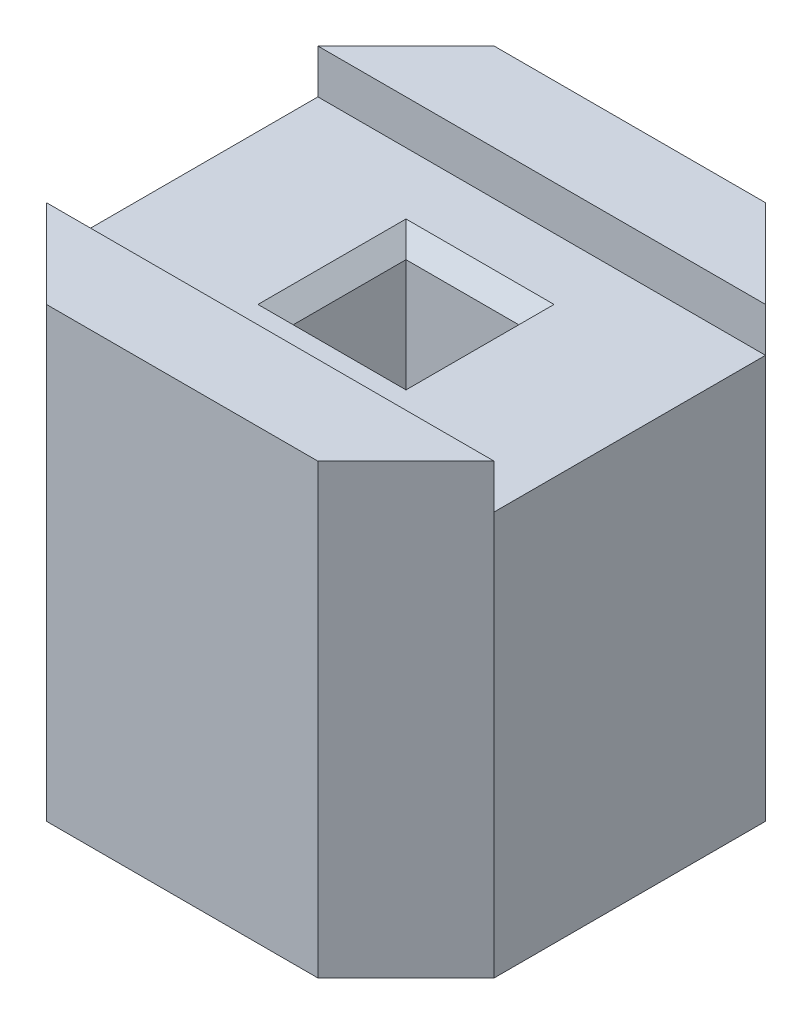
ISO-10303-21;
HEADER;
FILE_DESCRIPTION(('STEP AP214'),'2;1');
FILE_NAME('part.step','',(''),(''),'','','');
FILE_SCHEMA(('AUTOMOTIVE_DESIGN { 1 0 10303 214 1 1 1 1 }'));
ENDSEC;
DATA;
#1=APPLICATION_CONTEXT('core data for automotive mechanical design processes');
#2=APPLICATION_PROTOCOL_DEFINITION('international standard','automotive_design',2000,#1);
#3=PRODUCT_CONTEXT('',#1,'mechanical');
#4=PRODUCT('Part','Part','',(#3));
#5=PRODUCT_RELATED_PRODUCT_CATEGORY('part','',(#4));
#6=PRODUCT_DEFINITION_FORMATION('','',#4);
#7=PRODUCT_DEFINITION_CONTEXT('part definition',#1,'design');
#8=PRODUCT_DEFINITION('design','',#6,#7);
#9=PRODUCT_DEFINITION_SHAPE('','',#8);
#10=(LENGTH_UNIT() NAMED_UNIT(*) SI_UNIT(.MILLI.,.METRE.));
#11=(NAMED_UNIT(*) PLANE_ANGLE_UNIT() SI_UNIT($,.RADIAN.));
#12=(NAMED_UNIT(*) SI_UNIT($,.STERADIAN.) SOLID_ANGLE_UNIT());
#13=UNCERTAINTY_MEASURE_WITH_UNIT(LENGTH_MEASURE(1.E-05),#10,'distance_accuracy_value','');
#14=(GEOMETRIC_REPRESENTATION_CONTEXT(3) GLOBAL_UNCERTAINTY_ASSIGNED_CONTEXT((#13)) GLOBAL_UNIT_ASSIGNED_CONTEXT((#10,
#11,#12)) REPRESENTATION_CONTEXT('',''));
#15=CARTESIAN_POINT('',(0.,0.,0.));
#16=DIRECTION('',(0.,0.,1.));
#17=DIRECTION('',(1.,0.,0.));
#18=AXIS2_PLACEMENT_3D('',#15,#16,#17);
#19=CARTESIAN_POINT('',(0.,0.,2.54));
#20=DIRECTION('',(1.,0.,0.));
#21=DIRECTION('',(0.,0.,-1.));
#22=AXIS2_PLACEMENT_3D('',#19,#20,#21);
#23=PLANE('',#22);
#24=DIRECTION('',(0.,0.,1.));
#25=VECTOR('',#24,1.);
#26=CARTESIAN_POINT('',(0.,-0.25,0.5));
#27=LINE('',#26,#25);
#28=CARTESIAN_POINT('',(0.,-0.25,0.5));
#29=VERTEX_POINT('',#28);
#30=CARTESIAN_POINT('',(0.,-0.25,2.04));
#31=VERTEX_POINT('',#30);
#32=EDGE_CURVE('E171',#29,#31,#27,.T.);
#33=ORIENTED_EDGE('',*,*,#32,.F.);
#34=DIRECTION('',(0.,-1.,0.));
#35=VECTOR('',#34,1.);
#36=CARTESIAN_POINT('',(0.,0.,0.5));
#37=LINE('',#36,#35);
#38=CARTESIAN_POINT('',(0.,-2.54,0.500000000000001));
#39=VERTEX_POINT('',#38);
#40=EDGE_CURVE('E220',#29,#39,#37,.T.);
#41=ORIENTED_EDGE('',*,*,#40,.T.);
#42=DIRECTION('',(0.,0.,-1.));
#43=VECTOR('',#42,1.);
#44=CARTESIAN_POINT('',(0.,-2.54,2.54));
#45=LINE('',#44,#43);
#46=CARTESIAN_POINT('',(0.,-2.54,2.04));
#47=VERTEX_POINT('',#46);
#48=EDGE_CURVE('E203',#47,#39,#45,.T.);
#49=ORIENTED_EDGE('',*,*,#48,.F.);
#50=DIRECTION('',(0.,1.,0.));
#51=VECTOR('',#50,1.);
#52=CARTESIAN_POINT('',(0.,0.,2.04));
#53=LINE('',#52,#51);
#54=EDGE_CURVE('E223',#47,#31,#53,.T.);
#55=ORIENTED_EDGE('',*,*,#54,.T.);
#56=EDGE_LOOP('',(#33,#41,#49,#55));
#57=FACE_BOUND('',#56,.T.);
#58=ADVANCED_FACE('F32',(#57),#23,.F.);
#59=CARTESIAN_POINT('',(2.54,0.,2.54));
#60=DIRECTION('',(-1.,0.,0.));
#61=DIRECTION('',(0.,-1.,0.));
#62=AXIS2_PLACEMENT_3D('',#59,#60,#61);
#63=PLANE('',#62);
#64=DIRECTION('',(0.,0.,1.));
#65=VECTOR('',#64,1.);
#66=CARTESIAN_POINT('',(2.54,-0.25,0.5));
#67=LINE('',#66,#65);
#68=CARTESIAN_POINT('',(2.54,-0.25,0.5));
#69=VERTEX_POINT('',#68);
#70=CARTESIAN_POINT('',(2.54,-0.25,2.04));
#71=VERTEX_POINT('',#70);
#72=EDGE_CURVE('E177',#69,#71,#67,.T.);
#73=ORIENTED_EDGE('',*,*,#72,.T.);
#74=DIRECTION('',(0.,-1.,0.));
#75=VECTOR('',#74,1.);
#76=CARTESIAN_POINT('',(2.54,-2.54,2.04));
#77=LINE('',#76,#75);
#78=CARTESIAN_POINT('',(2.54,-2.54,2.04));
#79=VERTEX_POINT('',#78);
#80=EDGE_CURVE('E240',#71,#79,#77,.T.);
#81=ORIENTED_EDGE('',*,*,#80,.T.);
#82=DIRECTION('',(0.,0.,-1.));
#83=VECTOR('',#82,1.);
#84=CARTESIAN_POINT('',(2.54,-2.54,2.54));
#85=LINE('',#84,#83);
#86=CARTESIAN_POINT('',(2.54,-2.54,0.5));
#87=VERTEX_POINT('',#86);
#88=EDGE_CURVE('E196',#79,#87,#85,.T.);
#89=ORIENTED_EDGE('',*,*,#88,.T.);
#90=DIRECTION('',(0.,1.,0.));
#91=VECTOR('',#90,1.);
#92=CARTESIAN_POINT('',(2.54,0.,0.5));
#93=LINE('',#92,#91);
#94=EDGE_CURVE('E243',#87,#69,#93,.T.);
#95=ORIENTED_EDGE('',*,*,#94,.T.);
#96=EDGE_LOOP('',(#73,#81,#89,#95));
#97=FACE_BOUND('',#96,.T.);
#98=ADVANCED_FACE('F305',(#97),#63,.F.);
#99=CARTESIAN_POINT('',(0.,0.,2.54));
#100=DIRECTION('',(0.,-1.,0.));
#101=DIRECTION('',(0.,0.,-1.));
#102=AXIS2_PLACEMENT_3D('',#99,#100,#101);
#103=PLANE('',#102);
#104=DIRECTION('',(1.,0.,0.));
#105=VECTOR('',#104,1.);
#106=CARTESIAN_POINT('',(0.,0.,0.5));
#107=LINE('',#106,#105);
#108=CARTESIAN_POINT('',(0.,0.,0.5));
#109=VERTEX_POINT('',#108);
#110=CARTESIAN_POINT('',(2.54,0.,0.5));
#111=VERTEX_POINT('',#110);
#112=EDGE_CURVE('E166',#109,#111,#107,.T.);
#113=ORIENTED_EDGE('',*,*,#112,.T.);
#114=DIRECTION('',(0.707106781186548,0.,0.707106781186547));
#115=VECTOR('',#114,1.);
#116=CARTESIAN_POINT('',(2.54,0.,0.5));
#117=LINE('',#116,#115);
#118=CARTESIAN_POINT('',(2.04,0.,0.));
#119=VERTEX_POINT('',#118);
#120=EDGE_CURVE('E229',#111,#119,#117,.F.);
#121=ORIENTED_EDGE('',*,*,#120,.T.);
#122=DIRECTION('',(-1.,0.,0.));
#123=VECTOR('',#122,1.);
#124=CARTESIAN_POINT('',(0.,0.,0.));
#125=LINE('',#124,#123);
#126=CARTESIAN_POINT('',(0.500000000000001,0.,0.));
#127=VERTEX_POINT('',#126);
#128=EDGE_CURVE('E193',#119,#127,#125,.T.);
#129=ORIENTED_EDGE('',*,*,#128,.T.);
#130=DIRECTION('',(0.707106781186548,0.,-0.707106781186547));
#131=VECTOR('',#130,1.);
#132=CARTESIAN_POINT('',(0.,0.,0.5));
#133=LINE('',#132,#131);
#134=EDGE_CURVE('E231',#127,#109,#133,.F.);
#135=ORIENTED_EDGE('',*,*,#134,.T.);
#136=EDGE_LOOP('',(#113,#121,#129,#135));
#137=FACE_BOUND('',#136,.T.);
#138=ADVANCED_FACE('F311',(#137),#103,.F.);
#139=CARTESIAN_POINT('',(0.,-2.54,2.54));
#140=DIRECTION('',(0.,1.,0.));
#141=DIRECTION('',(0.,0.,1.));
#142=AXIS2_PLACEMENT_3D('',#139,#140,#141);
#143=PLANE('',#142);
#144=DIRECTION('',(1.,0.,0.));
#145=VECTOR('',#144,1.);
#146=CARTESIAN_POINT('',(0.,-2.54,1.59));
#147=LINE('',#146,#145);
#148=CARTESIAN_POINT('',(0.95,-2.54,1.59));
#149=VERTEX_POINT('',#148);
#150=CARTESIAN_POINT('',(1.59,-2.54,1.59));
#151=VERTEX_POINT('',#150);
#152=EDGE_CURVE('E163',#149,#151,#147,.T.);
#153=ORIENTED_EDGE('',*,*,#152,.T.);
#154=DIRECTION('',(0.,0.,-1.));
#155=VECTOR('',#154,1.);
#156=CARTESIAN_POINT('',(1.59,-2.54,2.54));
#157=LINE('',#156,#155);
#158=CARTESIAN_POINT('',(1.59,-2.54,0.95));
#159=VERTEX_POINT('',#158);
#160=EDGE_CURVE('E157',#151,#159,#157,.T.);
#161=ORIENTED_EDGE('',*,*,#160,.T.);
#162=DIRECTION('',(-1.,0.,0.));
#163=VECTOR('',#162,1.);
#164=CARTESIAN_POINT('',(0.,-2.54,0.95));
#165=LINE('',#164,#163);
#166=CARTESIAN_POINT('',(0.95,-2.54,0.95));
#167=VERTEX_POINT('',#166);
#168=EDGE_CURVE('E145',#159,#167,#165,.T.);
#169=ORIENTED_EDGE('',*,*,#168,.T.);
#170=DIRECTION('',(0.,0.,1.));
#171=VECTOR('',#170,1.);
#172=CARTESIAN_POINT('',(0.95,-2.54,2.54));
#173=LINE('',#172,#171);
#174=EDGE_CURVE('E153',#167,#149,#173,.T.);
#175=ORIENTED_EDGE('',*,*,#174,.T.);
#176=EDGE_LOOP('',(#153,#161,#169,#175));
#177=FACE_BOUND('',#176,.T.);
#178=DIRECTION('',(1.,0.,0.));
#179=VECTOR('',#178,1.);
#180=CARTESIAN_POINT('',(0.,-2.54,2.54));
#181=LINE('',#180,#179);
#182=CARTESIAN_POINT('',(0.5,-2.54,2.54));
#183=VERTEX_POINT('',#182);
#184=CARTESIAN_POINT('',(2.04,-2.54,2.54));
#185=VERTEX_POINT('',#184);
#186=EDGE_CURVE('E189',#183,#185,#181,.T.);
#187=ORIENTED_EDGE('',*,*,#186,.F.);
#188=DIRECTION('',(-0.707106781186547,0.,-0.707106781186548));
#189=VECTOR('',#188,1.);
#190=CARTESIAN_POINT('',(0.5,-2.54,2.54));
#191=LINE('',#190,#189);
#192=EDGE_CURVE('E218',#183,#47,#191,.T.);
#193=ORIENTED_EDGE('',*,*,#192,.T.);
#194=ORIENTED_EDGE('',*,*,#48,.T.);
#195=DIRECTION('',(-0.707106781186548,0.,0.707106781186547));
#196=VECTOR('',#195,1.);
#197=CARTESIAN_POINT('',(0.,-2.54,0.5));
#198=LINE('',#197,#196);
#199=CARTESIAN_POINT('',(0.500000000000001,-2.54,0.));
#200=VERTEX_POINT('',#199);
#201=EDGE_CURVE('E216',#39,#200,#198,.F.);
#202=ORIENTED_EDGE('',*,*,#201,.T.);
#203=DIRECTION('',(1.,0.,0.));
#204=VECTOR('',#203,1.);
#205=CARTESIAN_POINT('',(0.,-2.54,0.));
#206=LINE('',#205,#204);
#207=CARTESIAN_POINT('',(2.04,-2.54,0.));
#208=VERTEX_POINT('',#207);
#209=EDGE_CURVE('E187',#200,#208,#206,.T.);
#210=ORIENTED_EDGE('',*,*,#209,.T.);
#211=DIRECTION('',(-0.707106781186548,0.,-0.707106781186547));
#212=VECTOR('',#211,1.);
#213=CARTESIAN_POINT('',(2.54,-2.54,0.5));
#214=LINE('',#213,#212);
#215=EDGE_CURVE('E214',#208,#87,#214,.F.);
#216=ORIENTED_EDGE('',*,*,#215,.T.);
#217=ORIENTED_EDGE('',*,*,#88,.F.);
#218=DIRECTION('',(-0.707106781186546,0.,0.707106781186549));
#219=VECTOR('',#218,1.);
#220=CARTESIAN_POINT('',(2.04,-2.54,2.54));
#221=LINE('',#220,#219);
#222=EDGE_CURVE('E212',#79,#185,#221,.T.);
#223=ORIENTED_EDGE('',*,*,#222,.T.);
#224=EDGE_LOOP('',(#187,#193,#194,#202,#210,#216,#217,#223));
#225=FACE_BOUND('',#224,.T.);
#226=ADVANCED_FACE('F161',(#177,#225),#143,.F.);
#227=DIRECTION('',(0.707106781186546,0.,-0.707106781186549));
#228=VECTOR('',#227,1.);
#229=CARTESIAN_POINT('',(2.04,0.,2.54));
#230=LINE('',#229,#228);
#231=CARTESIAN_POINT('',(2.04,0.,2.54));
#232=VERTEX_POINT('',#231);
#233=CARTESIAN_POINT('',(2.54,0.,2.04));
#234=VERTEX_POINT('',#233);
#235=EDGE_CURVE('E226',#232,#234,#230,.T.);
#236=ORIENTED_EDGE('',*,*,#235,.T.);
#237=DIRECTION('',(1.,0.,0.));
#238=VECTOR('',#237,1.);
#239=CARTESIAN_POINT('',(0.,0.,2.04));
#240=LINE('',#239,#238);
#241=CARTESIAN_POINT('',(0.,0.,2.04));
#242=VERTEX_POINT('',#241);
#243=EDGE_CURVE('E164',#242,#234,#240,.T.);
#244=ORIENTED_EDGE('',*,*,#243,.F.);
#245=DIRECTION('',(0.707106781186547,0.,0.707106781186548));
#246=VECTOR('',#245,1.);
#247=CARTESIAN_POINT('',(0.5,0.,2.54));
#248=LINE('',#247,#246);
#249=CARTESIAN_POINT('',(0.5,0.,2.54));
#250=VERTEX_POINT('',#249);
#251=EDGE_CURVE('E234',#242,#250,#248,.T.);
#252=ORIENTED_EDGE('',*,*,#251,.T.);
#253=DIRECTION('',(-1.,0.,0.));
#254=VECTOR('',#253,1.);
#255=CARTESIAN_POINT('',(0.,0.,2.54));
#256=LINE('',#255,#254);
#257=EDGE_CURVE('E192',#232,#250,#256,.T.);
#258=ORIENTED_EDGE('',*,*,#257,.F.);
#259=EDGE_LOOP('',(#236,#244,#252,#258));
#260=FACE_BOUND('',#259,.T.);
#261=ADVANCED_FACE('F386',(#260),#103,.F.);
#262=CARTESIAN_POINT('',(0.,0.,2.54));
#263=DIRECTION('',(0.,0.,1.));
#264=DIRECTION('',(1.,0.,0.));
#265=AXIS2_PLACEMENT_3D('',#262,#263,#264);
#266=PLANE('',#265);
#267=ORIENTED_EDGE('',*,*,#257,.T.);
#268=DIRECTION('',(0.,-1.,0.));
#269=VECTOR('',#268,1.);
#270=CARTESIAN_POINT('',(0.5,-2.54,2.54));
#271=LINE('',#270,#269);
#272=EDGE_CURVE('E209',#250,#183,#271,.T.);
#273=ORIENTED_EDGE('',*,*,#272,.T.);
#274=ORIENTED_EDGE('',*,*,#186,.T.);
#275=DIRECTION('',(0.,1.,0.));
#276=VECTOR('',#275,1.);
#277=CARTESIAN_POINT('',(2.04,0.,2.54));
#278=LINE('',#277,#276);
#279=EDGE_CURVE('E206',#185,#232,#278,.T.);
#280=ORIENTED_EDGE('',*,*,#279,.T.);
#281=EDGE_LOOP('',(#267,#273,#274,#280));
#282=FACE_BOUND('',#281,.T.);
#283=ADVANCED_FACE('F439',(#282),#266,.T.);
#284=CARTESIAN_POINT('',(0.,0.,0.));
#285=DIRECTION('',(0.,0.,1.));
#286=DIRECTION('',(1.,0.,0.));
#287=AXIS2_PLACEMENT_3D('',#284,#285,#286);
#288=PLANE('',#287);
#289=ORIENTED_EDGE('',*,*,#209,.F.);
#290=DIRECTION('',(0.,1.,0.));
#291=VECTOR('',#290,1.);
#292=CARTESIAN_POINT('',(0.500000000000001,0.,0.));
#293=LINE('',#292,#291);
#294=EDGE_CURVE('E238',#200,#127,#293,.T.);
#295=ORIENTED_EDGE('',*,*,#294,.T.);
#296=ORIENTED_EDGE('',*,*,#128,.F.);
#297=DIRECTION('',(0.,-1.,0.));
#298=VECTOR('',#297,1.);
#299=CARTESIAN_POINT('',(2.04,0.,0.));
#300=LINE('',#299,#298);
#301=EDGE_CURVE('E236',#119,#208,#300,.T.);
#302=ORIENTED_EDGE('',*,*,#301,.T.);
#303=EDGE_LOOP('',(#289,#295,#296,#302));
#304=FACE_BOUND('',#303,.T.);
#305=ADVANCED_FACE('F321',(#304),#288,.F.);
#306=CARTESIAN_POINT('',(0.5,0.,2.54));
#307=DIRECTION('',(-0.707106781186548,0.,0.707106781186547));
#308=DIRECTION('',(0.,1.,0.));
#309=AXIS2_PLACEMENT_3D('',#306,#307,#308);
#310=PLANE('',#309);
#311=ORIENTED_EDGE('',*,*,#251,.F.);
#312=DIRECTION('',(0.,1.,0.));
#313=VECTOR('',#312,1.);
#314=CARTESIAN_POINT('',(0.,-0.25,2.04));
#315=LINE('',#314,#313);
#316=EDGE_CURVE('E181',#31,#242,#315,.T.);
#317=ORIENTED_EDGE('',*,*,#316,.F.);
#318=ORIENTED_EDGE('',*,*,#54,.F.);
#319=ORIENTED_EDGE('',*,*,#192,.F.);
#320=ORIENTED_EDGE('',*,*,#272,.F.);
#321=EDGE_LOOP('',(#311,#317,#318,#319,#320));
#322=FACE_BOUND('',#321,.T.);
#323=ADVANCED_FACE('F317',(#322),#310,.T.);
#324=CARTESIAN_POINT('',(0.,0.,0.5));
#325=DIRECTION('',(0.707106781186547,0.,0.707106781186548));
#326=DIRECTION('',(0.,-1.,0.));
#327=AXIS2_PLACEMENT_3D('',#324,#325,#326);
#328=PLANE('',#327);
#329=ORIENTED_EDGE('',*,*,#134,.F.);
#330=ORIENTED_EDGE('',*,*,#294,.F.);
#331=ORIENTED_EDGE('',*,*,#201,.F.);
#332=ORIENTED_EDGE('',*,*,#40,.F.);
#333=EDGE_CURVE('E221',#109,#29,#37,.T.);
#334=ORIENTED_EDGE('',*,*,#333,.F.);
#335=EDGE_LOOP('',(#329,#330,#331,#332,#334));
#336=FACE_BOUND('',#335,.T.);
#337=ADVANCED_FACE('F320',(#336),#328,.F.);
#338=CARTESIAN_POINT('',(2.54,0.,0.5));
#339=DIRECTION('',(-0.707106781186547,0.,0.707106781186548));
#340=DIRECTION('',(0.,1.,0.));
#341=AXIS2_PLACEMENT_3D('',#338,#339,#340);
#342=PLANE('',#341);
#343=ORIENTED_EDGE('',*,*,#215,.F.);
#344=ORIENTED_EDGE('',*,*,#301,.F.);
#345=ORIENTED_EDGE('',*,*,#120,.F.);
#346=DIRECTION('',(0.,1.,0.));
#347=VECTOR('',#346,1.);
#348=CARTESIAN_POINT('',(2.54,-0.25,0.5));
#349=LINE('',#348,#347);
#350=EDGE_CURVE('E185',#69,#111,#349,.T.);
#351=ORIENTED_EDGE('',*,*,#350,.F.);
#352=ORIENTED_EDGE('',*,*,#94,.F.);
#353=EDGE_LOOP('',(#343,#344,#345,#351,#352));
#354=FACE_BOUND('',#353,.T.);
#355=ADVANCED_FACE('F325',(#354),#342,.F.);
#356=CARTESIAN_POINT('',(2.04,0.,2.54));
#357=DIRECTION('',(0.707106781186549,0.,0.707106781186546));
#358=DIRECTION('',(0.,-1.,0.));
#359=AXIS2_PLACEMENT_3D('',#356,#357,#358);
#360=PLANE('',#359);
#361=ORIENTED_EDGE('',*,*,#222,.F.);
#362=ORIENTED_EDGE('',*,*,#80,.F.);
#363=EDGE_CURVE('E241',#234,#71,#77,.T.);
#364=ORIENTED_EDGE('',*,*,#363,.F.);
#365=ORIENTED_EDGE('',*,*,#235,.F.);
#366=ORIENTED_EDGE('',*,*,#279,.F.);
#367=EDGE_LOOP('',(#361,#362,#364,#365,#366));
#368=FACE_BOUND('',#367,.T.);
#369=ADVANCED_FACE('F329',(#368),#360,.T.);
#370=CARTESIAN_POINT('',(0.,-0.25,0.5));
#371=DIRECTION('',(0.,0.,1.));
#372=DIRECTION('',(1.,0.,0.));
#373=AXIS2_PLACEMENT_3D('',#370,#371,#372);
#374=PLANE('',#373);
#375=ORIENTED_EDGE('',*,*,#112,.F.);
#376=ORIENTED_EDGE('',*,*,#333,.T.);
#377=DIRECTION('',(1.,0.,0.));
#378=VECTOR('',#377,1.);
#379=CARTESIAN_POINT('',(0.,-0.25,0.5));
#380=LINE('',#379,#378);
#381=EDGE_CURVE('E180',#29,#69,#380,.T.);
#382=ORIENTED_EDGE('',*,*,#381,.T.);
#383=ORIENTED_EDGE('',*,*,#350,.T.);
#384=EDGE_LOOP('',(#375,#376,#382,#383));
#385=FACE_BOUND('',#384,.T.);
#386=ADVANCED_FACE('F333',(#385),#374,.T.);
#387=CARTESIAN_POINT('',(0.,-0.25,2.04));
#388=DIRECTION('',(0.,0.,1.));
#389=DIRECTION('',(1.,0.,0.));
#390=AXIS2_PLACEMENT_3D('',#387,#388,#389);
#391=PLANE('',#390);
#392=ORIENTED_EDGE('',*,*,#243,.T.);
#393=ORIENTED_EDGE('',*,*,#363,.T.);
#394=DIRECTION('',(1.,0.,0.));
#395=VECTOR('',#394,1.);
#396=CARTESIAN_POINT('',(0.,-0.25,2.04));
#397=LINE('',#396,#395);
#398=EDGE_CURVE('E174',#31,#71,#397,.T.);
#399=ORIENTED_EDGE('',*,*,#398,.F.);
#400=ORIENTED_EDGE('',*,*,#316,.T.);
#401=EDGE_LOOP('',(#392,#393,#399,#400));
#402=FACE_BOUND('',#401,.T.);
#403=ADVANCED_FACE('F375',(#402),#391,.F.);
#404=CARTESIAN_POINT('',(0.,-0.25,0.));
#405=DIRECTION('',(0.,1.,0.));
#406=DIRECTION('',(0.,0.,1.));
#407=AXIS2_PLACEMENT_3D('',#404,#405,#406);
#408=PLANE('',#407);
#409=DIRECTION('',(0.,0.,1.));
#410=VECTOR('',#409,1.);
#411=CARTESIAN_POINT('',(1.69,-0.25,1.59));
#412=LINE('',#411,#410);
#413=CARTESIAN_POINT('',(1.69,-0.25,0.849999999999999));
#414=VERTEX_POINT('',#413);
#415=CARTESIAN_POINT('',(1.69,-0.25,1.69));
#416=VERTEX_POINT('',#415);
#417=EDGE_CURVE('E253',#414,#416,#412,.T.);
#418=ORIENTED_EDGE('',*,*,#417,.T.);
#419=DIRECTION('',(-1.,0.,0.));
#420=VECTOR('',#419,1.);
#421=CARTESIAN_POINT('',(0.95,-0.25,1.69));
#422=LINE('',#421,#420);
#423=CARTESIAN_POINT('',(0.849999999999999,-0.25,1.69));
#424=VERTEX_POINT('',#423);
#425=EDGE_CURVE('E255',#416,#424,#422,.T.);
#426=ORIENTED_EDGE('',*,*,#425,.T.);
#427=DIRECTION('',(0.,0.,-1.));
#428=VECTOR('',#427,1.);
#429=CARTESIAN_POINT('',(0.849999999999999,-0.25,0.95));
#430=LINE('',#429,#428);
#431=CARTESIAN_POINT('',(0.849999999999999,-0.25,0.849999999999999));
#432=VERTEX_POINT('',#431);
#433=EDGE_CURVE('E251',#424,#432,#430,.T.);
#434=ORIENTED_EDGE('',*,*,#433,.T.);
#435=DIRECTION('',(1.,0.,0.));
#436=VECTOR('',#435,1.);
#437=CARTESIAN_POINT('',(1.59,-0.25,0.849999999999999));
#438=LINE('',#437,#436);
#439=EDGE_CURVE('E249',#432,#414,#438,.T.);
#440=ORIENTED_EDGE('',*,*,#439,.T.);
#441=EDGE_LOOP('',(#418,#426,#434,#440));
#442=FACE_BOUND('',#441,.T.);
#443=ORIENTED_EDGE('',*,*,#32,.T.);
#444=ORIENTED_EDGE('',*,*,#398,.T.);
#445=ORIENTED_EDGE('',*,*,#72,.F.);
#446=ORIENTED_EDGE('',*,*,#381,.F.);
#447=EDGE_LOOP('',(#443,#444,#445,#446));
#448=FACE_BOUND('',#447,.T.);
#449=ADVANCED_FACE('F278',(#442,#448),#408,.T.);
#450=CARTESIAN_POINT('',(1.59,-3.25,0.95));
#451=DIRECTION('',(1.,0.,0.));
#452=DIRECTION('',(0.,0.,-1.));
#453=AXIS2_PLACEMENT_3D('',#450,#451,#452);
#454=PLANE('',#453);
#455=DIRECTION('',(0.,1.,0.));
#456=VECTOR('',#455,1.);
#457=CARTESIAN_POINT('',(1.59,-3.25,1.59));
#458=LINE('',#457,#456);
#459=CARTESIAN_POINT('',(1.59,-0.35,1.59));
#460=VERTEX_POINT('',#459);
#461=EDGE_CURVE('E154',#151,#460,#458,.T.);
#462=ORIENTED_EDGE('',*,*,#461,.T.);
#463=DIRECTION('',(0.,0.,-1.));
#464=VECTOR('',#463,1.);
#465=CARTESIAN_POINT('',(1.59,-0.35,0.95));
#466=LINE('',#465,#464);
#467=CARTESIAN_POINT('',(1.59,-0.35,0.95));
#468=VERTEX_POINT('',#467);
#469=EDGE_CURVE('E55',#460,#468,#466,.T.);
#470=ORIENTED_EDGE('',*,*,#469,.T.);
#471=DIRECTION('',(0.,1.,0.));
#472=VECTOR('',#471,1.);
#473=CARTESIAN_POINT('',(1.59,-3.25,0.95));
#474=LINE('',#473,#472);
#475=EDGE_CURVE('E147',#159,#468,#474,.T.);
#476=ORIENTED_EDGE('',*,*,#475,.F.);
#477=ORIENTED_EDGE('',*,*,#160,.F.);
#478=EDGE_LOOP('',(#462,#470,#476,#477));
#479=FACE_BOUND('',#478,.T.);
#480=ADVANCED_FACE('F156',(#479),#454,.F.);
#481=CARTESIAN_POINT('',(0.95,-3.25,1.59));
#482=DIRECTION('',(0.,0.,1.));
#483=DIRECTION('',(1.,0.,0.));
#484=AXIS2_PLACEMENT_3D('',#481,#482,#483);
#485=PLANE('',#484);
#486=DIRECTION('',(0.,1.,0.));
#487=VECTOR('',#486,1.);
#488=CARTESIAN_POINT('',(0.95,-3.25,1.59));
#489=LINE('',#488,#487);
#490=CARTESIAN_POINT('',(0.95,-0.35,1.59));
#491=VERTEX_POINT('',#490);
#492=EDGE_CURVE('E290',#149,#491,#489,.T.);
#493=ORIENTED_EDGE('',*,*,#492,.T.);
#494=DIRECTION('',(1.,0.,0.));
#495=VECTOR('',#494,1.);
#496=CARTESIAN_POINT('',(1.59,-0.35,1.59));
#497=LINE('',#496,#495);
#498=EDGE_CURVE('E246',#491,#460,#497,.T.);
#499=ORIENTED_EDGE('',*,*,#498,.T.);
#500=ORIENTED_EDGE('',*,*,#461,.F.);
#501=ORIENTED_EDGE('',*,*,#152,.F.);
#502=EDGE_LOOP('',(#493,#499,#500,#501));
#503=FACE_BOUND('',#502,.T.);
#504=ADVANCED_FACE('F288',(#503),#485,.F.);
#505=CARTESIAN_POINT('',(0.95,-3.25,0.95));
#506=DIRECTION('',(-1.,0.,0.));
#507=DIRECTION('',(0.,0.,1.));
#508=AXIS2_PLACEMENT_3D('',#505,#506,#507);
#509=PLANE('',#508);
#510=DIRECTION('',(0.,1.,0.));
#511=VECTOR('',#510,1.);
#512=CARTESIAN_POINT('',(0.95,-3.25,0.95));
#513=LINE('',#512,#511);
#514=CARTESIAN_POINT('',(0.95,-0.35,0.95));
#515=VERTEX_POINT('',#514);
#516=EDGE_CURVE('E148',#167,#515,#513,.T.);
#517=ORIENTED_EDGE('',*,*,#516,.T.);
#518=DIRECTION('',(0.,0.,1.));
#519=VECTOR('',#518,1.);
#520=CARTESIAN_POINT('',(0.95,-0.35,1.59));
#521=LINE('',#520,#519);
#522=EDGE_CURVE('E41',#515,#491,#521,.T.);
#523=ORIENTED_EDGE('',*,*,#522,.T.);
#524=ORIENTED_EDGE('',*,*,#492,.F.);
#525=ORIENTED_EDGE('',*,*,#174,.F.);
#526=EDGE_LOOP('',(#517,#523,#524,#525));
#527=FACE_BOUND('',#526,.T.);
#528=ADVANCED_FACE('F295',(#527),#509,.F.);
#529=CARTESIAN_POINT('',(0.95,-3.25,0.95));
#530=DIRECTION('',(0.,0.,-1.));
#531=DIRECTION('',(-1.,0.,0.));
#532=AXIS2_PLACEMENT_3D('',#529,#530,#531);
#533=PLANE('',#532);
#534=ORIENTED_EDGE('',*,*,#475,.T.);
#535=DIRECTION('',(-1.,0.,0.));
#536=VECTOR('',#535,1.);
#537=CARTESIAN_POINT('',(0.95,-0.35,0.95));
#538=LINE('',#537,#536);
#539=EDGE_CURVE('E11',#468,#515,#538,.T.);
#540=ORIENTED_EDGE('',*,*,#539,.T.);
#541=ORIENTED_EDGE('',*,*,#516,.F.);
#542=ORIENTED_EDGE('',*,*,#168,.F.);
#543=EDGE_LOOP('',(#534,#540,#541,#542));
#544=FACE_BOUND('',#543,.T.);
#545=ADVANCED_FACE('F146',(#544),#533,.F.);
#546=CARTESIAN_POINT('',(0.95,-0.35,0.95));
#547=DIRECTION('',(0.,0.707106781186551,0.707106781186544));
#548=DIRECTION('',(1.,0.,0.));
#549=AXIS2_PLACEMENT_3D('',#546,#547,#548);
#550=PLANE('',#549);
#551=DIRECTION('',(0.577350269189628,0.577350269189622,-0.577350269189628));
#552=VECTOR('',#551,1.);
#553=CARTESIAN_POINT('',(1.59,-0.35,0.95));
#554=LINE('',#553,#552);
#555=EDGE_CURVE('E263',#414,#468,#554,.F.);
#556=ORIENTED_EDGE('',*,*,#555,.F.);
#557=ORIENTED_EDGE('',*,*,#439,.F.);
#558=DIRECTION('',(0.577350269189628,-0.577350269189622,0.577350269189628));
#559=VECTOR('',#558,1.);
#560=CARTESIAN_POINT('',(0.95,-0.35,0.95));
#561=LINE('',#560,#559);
#562=EDGE_CURVE('E36',#515,#432,#561,.F.);
#563=ORIENTED_EDGE('',*,*,#562,.F.);
#564=ORIENTED_EDGE('',*,*,#539,.F.);
#565=EDGE_LOOP('',(#556,#557,#563,#564));
#566=FACE_BOUND('',#565,.T.);
#567=ADVANCED_FACE('F34',(#566),#550,.T.);
#568=CARTESIAN_POINT('',(0.95,-0.35,0.95));
#569=DIRECTION('',(0.707106781186544,0.707106781186551,0.));
#570=DIRECTION('',(0.,0.,-1.));
#571=AXIS2_PLACEMENT_3D('',#568,#569,#570);
#572=PLANE('',#571);
#573=ORIENTED_EDGE('',*,*,#562,.T.);
#574=ORIENTED_EDGE('',*,*,#433,.F.);
#575=DIRECTION('',(0.577350269189628,-0.577350269189622,-0.577350269189628));
#576=VECTOR('',#575,1.);
#577=CARTESIAN_POINT('',(0.95,-0.35,1.59));
#578=LINE('',#577,#576);
#579=EDGE_CURVE('E262',#491,#424,#578,.F.);
#580=ORIENTED_EDGE('',*,*,#579,.F.);
#581=ORIENTED_EDGE('',*,*,#522,.F.);
#582=EDGE_LOOP('',(#573,#574,#580,#581));
#583=FACE_BOUND('',#582,.T.);
#584=ADVANCED_FACE('F273',(#583),#572,.T.);
#585=CARTESIAN_POINT('',(1.59,-0.35,0.95));
#586=DIRECTION('',(-0.707106781186544,0.707106781186551,0.));
#587=DIRECTION('',(0.,0.,1.));
#588=AXIS2_PLACEMENT_3D('',#585,#586,#587);
#589=PLANE('',#588);
#590=ORIENTED_EDGE('',*,*,#555,.T.);
#591=ORIENTED_EDGE('',*,*,#469,.F.);
#592=DIRECTION('',(0.577350269189628,0.577350269189622,0.577350269189628));
#593=VECTOR('',#592,1.);
#594=CARTESIAN_POINT('',(1.37666666666667,-0.563333333333332,1.37666666666667));
#595=LINE('',#594,#593);
#596=EDGE_CURVE('E260',#416,#460,#595,.F.);
#597=ORIENTED_EDGE('',*,*,#596,.F.);
#598=ORIENTED_EDGE('',*,*,#417,.F.);
#599=EDGE_LOOP('',(#590,#591,#597,#598));
#600=FACE_BOUND('',#599,.T.);
#601=ADVANCED_FACE('F285',(#600),#589,.T.);
#602=CARTESIAN_POINT('',(0.95,-0.35,1.59));
#603=DIRECTION('',(0.,0.707106781186551,-0.707106781186544));
#604=DIRECTION('',(-1.,0.,0.));
#605=AXIS2_PLACEMENT_3D('',#602,#603,#604);
#606=PLANE('',#605);
#607=ORIENTED_EDGE('',*,*,#579,.T.);
#608=ORIENTED_EDGE('',*,*,#425,.F.);
#609=ORIENTED_EDGE('',*,*,#596,.T.);
#610=ORIENTED_EDGE('',*,*,#498,.F.);
#611=EDGE_LOOP('',(#607,#608,#609,#610));
#612=FACE_BOUND('',#611,.T.);
#613=ADVANCED_FACE('F283',(#612),#606,.T.);
#614=CLOSED_SHELL('',(#58,#98,#138,#226,#261,#283,#305,#323,#337,#355,#369,#386,#403,#449,#480,
#504,#528,#545,#567,#584,#601,#613));
#615=MANIFOLD_SOLID_BREP('B2',#614);
#616=ADVANCED_BREP_SHAPE_REPRESENTATION('',(#18,#615),#14);
#617=SHAPE_DEFINITION_REPRESENTATION(#9,#616);
ENDSEC;
END-ISO-10303-21;
